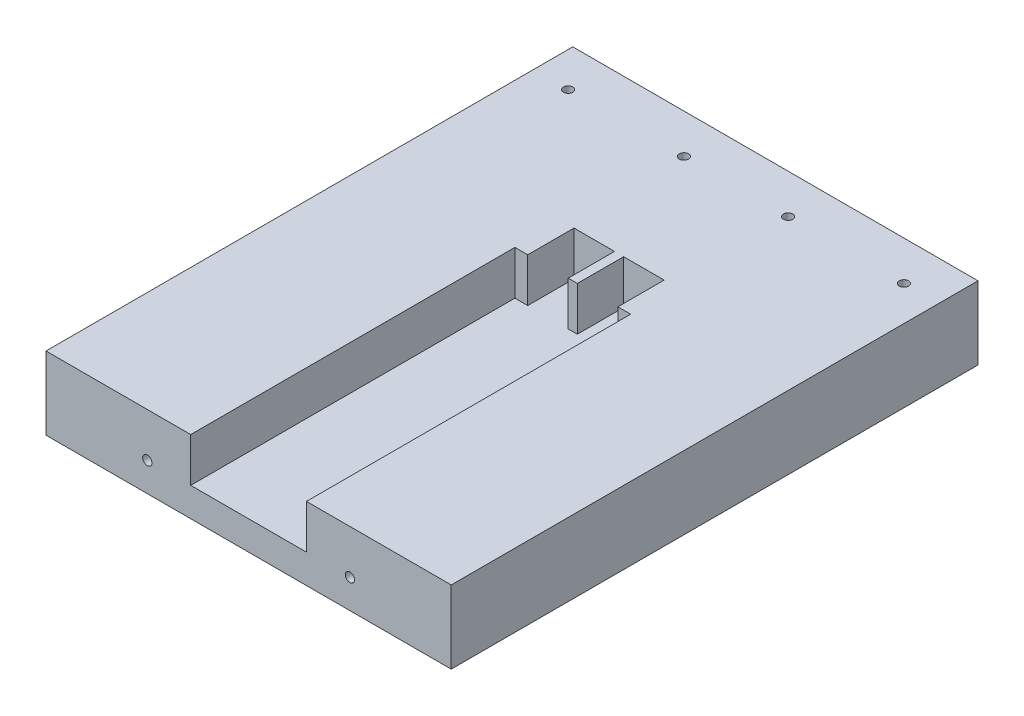
ISO-10303-21;
HEADER;
FILE_DESCRIPTION(('STEP AP214'),'2;1');
FILE_NAME('part.step','',(''),(''),'','','');
FILE_SCHEMA(('AUTOMOTIVE_DESIGN { 1 0 10303 214 1 1 1 1 }'));
ENDSEC;
DATA;
#1=APPLICATION_CONTEXT('core data for automotive mechanical design processes');
#2=APPLICATION_PROTOCOL_DEFINITION('international standard','automotive_design',2000,#1);
#3=PRODUCT_CONTEXT('',#1,'mechanical');
#4=PRODUCT('Part','Part','',(#3));
#5=PRODUCT_RELATED_PRODUCT_CATEGORY('part','',(#4));
#6=PRODUCT_DEFINITION_FORMATION('','',#4);
#7=PRODUCT_DEFINITION_CONTEXT('part definition',#1,'design');
#8=PRODUCT_DEFINITION('design','',#6,#7);
#9=PRODUCT_DEFINITION_SHAPE('','',#8);
#10=(LENGTH_UNIT() NAMED_UNIT(*) SI_UNIT(.MILLI.,.METRE.));
#11=(NAMED_UNIT(*) PLANE_ANGLE_UNIT() SI_UNIT($,.RADIAN.));
#12=(NAMED_UNIT(*) SI_UNIT($,.STERADIAN.) SOLID_ANGLE_UNIT());
#13=UNCERTAINTY_MEASURE_WITH_UNIT(LENGTH_MEASURE(1.E-05),#10,'distance_accuracy_value','');
#14=(GEOMETRIC_REPRESENTATION_CONTEXT(3) GLOBAL_UNCERTAINTY_ASSIGNED_CONTEXT((#13)) GLOBAL_UNIT_ASSIGNED_CONTEXT((#10,
#11,#12)) REPRESENTATION_CONTEXT('',''));
#15=CARTESIAN_POINT('',(0.,0.,0.));
#16=DIRECTION('',(0.,0.,1.));
#17=DIRECTION('',(1.,0.,0.));
#18=AXIS2_PLACEMENT_3D('',#15,#16,#17);
#19=CARTESIAN_POINT('',(0.,16.002,-71.12));
#20=DIRECTION('',(0.,0.,-1.));
#21=DIRECTION('',(-1.,0.,0.));
#22=AXIS2_PLACEMENT_3D('',#19,#20,#21);
#23=PLANE('',#22);
#24=DIRECTION('',(0.,-1.,0.));
#25=VECTOR('',#24,1.);
#26=CARTESIAN_POINT('',(31.75,16.002,-71.12));
#27=LINE('',#26,#25);
#28=CARTESIAN_POINT('',(31.75,16.002,-71.12));
#29=VERTEX_POINT('',#28);
#30=CARTESIAN_POINT('',(31.75,6.35,-71.12));
#31=VERTEX_POINT('',#30);
#32=EDGE_CURVE('E257',#29,#31,#27,.T.);
#33=ORIENTED_EDGE('',*,*,#32,.T.);
#34=DIRECTION('',(1.,0.,0.));
#35=VECTOR('',#34,1.);
#36=CARTESIAN_POINT('',(0.,6.35,-71.12));
#37=LINE('',#36,#35);
#38=CARTESIAN_POINT('',(34.56,6.35,-71.12));
#39=VERTEX_POINT('',#38);
#40=EDGE_CURVE('E166',#31,#39,#37,.T.);
#41=ORIENTED_EDGE('',*,*,#40,.T.);
#42=DIRECTION('',(0.,-1.,0.));
#43=VECTOR('',#42,1.);
#44=CARTESIAN_POINT('',(34.56,16.002,-71.12));
#45=LINE('',#44,#43);
#46=CARTESIAN_POINT('',(34.56,16.002,-71.12));
#47=VERTEX_POINT('',#46);
#48=EDGE_CURVE('E254',#47,#39,#45,.T.);
#49=ORIENTED_EDGE('',*,*,#48,.F.);
#50=DIRECTION('',(1.,0.,0.));
#51=VECTOR('',#50,1.);
#52=CARTESIAN_POINT('',(0.,16.002,-71.12));
#53=LINE('',#52,#51);
#54=EDGE_CURVE('E203',#29,#47,#53,.T.);
#55=ORIENTED_EDGE('',*,*,#54,.F.);
#56=EDGE_LOOP('',(#33,#41,#49,#55));
#57=FACE_BOUND('',#56,.T.);
#58=ADVANCED_FACE('F38',(#57),#23,.F.);
#59=CARTESIAN_POINT('',(54.34,16.002,0.));
#60=DIRECTION('',(-1.,0.,0.));
#61=DIRECTION('',(0.,0.,1.));
#62=AXIS2_PLACEMENT_3D('',#59,#60,#61);
#63=PLANE('',#62);
#64=DIRECTION('',(0.,0.,-1.));
#65=VECTOR('',#64,1.);
#66=CARTESIAN_POINT('',(54.34,6.35,0.));
#67=LINE('',#66,#65);
#68=CARTESIAN_POINT('',(54.34,6.35,-71.12));
#69=VERTEX_POINT('',#68);
#70=CARTESIAN_POINT('',(54.34,6.35,-81.28));
#71=VERTEX_POINT('',#70);
#72=EDGE_CURVE('E158',#69,#71,#67,.T.);
#73=ORIENTED_EDGE('',*,*,#72,.F.);
#74=DIRECTION('',(0.,-1.,0.));
#75=VECTOR('',#74,1.);
#76=CARTESIAN_POINT('',(54.34,16.002,-71.12));
#77=LINE('',#76,#75);
#78=CARTESIAN_POINT('',(54.34,16.002,-71.12));
#79=VERTEX_POINT('',#78);
#80=EDGE_CURVE('E11',#79,#69,#77,.T.);
#81=ORIENTED_EDGE('',*,*,#80,.F.);
#82=DIRECTION('',(0.,0.,-1.));
#83=VECTOR('',#82,1.);
#84=CARTESIAN_POINT('',(54.34,16.002,0.));
#85=LINE('',#84,#83);
#86=CARTESIAN_POINT('',(54.34,16.002,-81.28));
#87=VERTEX_POINT('',#86);
#88=EDGE_CURVE('E197',#79,#87,#85,.T.);
#89=ORIENTED_EDGE('',*,*,#88,.T.);
#90=DIRECTION('',(0.,-1.,0.));
#91=VECTOR('',#90,1.);
#92=CARTESIAN_POINT('',(54.34,16.002,-81.28));
#93=LINE('',#92,#91);
#94=EDGE_CURVE('E173',#87,#71,#93,.T.);
#95=ORIENTED_EDGE('',*,*,#94,.T.);
#96=EDGE_LOOP('',(#73,#81,#89,#95));
#97=FACE_BOUND('',#96,.T.);
#98=ADVANCED_FACE('F40',(#97),#63,.T.);
#99=ORIENTED_EDGE('',*,*,#80,.T.);
#100=CARTESIAN_POINT('',(57.15,6.35,-71.12));
#101=VERTEX_POINT('',#100);
#102=EDGE_CURVE('E154',#69,#101,#37,.T.);
#103=ORIENTED_EDGE('',*,*,#102,.T.);
#104=DIRECTION('',(0.,-1.,0.));
#105=VECTOR('',#104,1.);
#106=CARTESIAN_POINT('',(57.15,16.002,-71.12));
#107=LINE('',#106,#105);
#108=CARTESIAN_POINT('',(57.15,16.002,-71.12));
#109=VERTEX_POINT('',#108);
#110=EDGE_CURVE('E46',#109,#101,#107,.T.);
#111=ORIENTED_EDGE('',*,*,#110,.F.);
#112=EDGE_CURVE('E169',#79,#109,#53,.T.);
#113=ORIENTED_EDGE('',*,*,#112,.F.);
#114=EDGE_LOOP('',(#99,#103,#111,#113));
#115=FACE_BOUND('',#114,.T.);
#116=ADVANCED_FACE('F168',(#115),#23,.F.);
#117=CARTESIAN_POINT('',(57.15,16.002,0.));
#118=DIRECTION('',(-1.,0.,0.));
#119=DIRECTION('',(0.,0.,1.));
#120=AXIS2_PLACEMENT_3D('',#117,#118,#119);
#121=PLANE('',#120);
#122=DIRECTION('',(0.,0.,-1.));
#123=VECTOR('',#122,1.);
#124=CARTESIAN_POINT('',(57.15,6.35,0.));
#125=LINE('',#124,#123);
#126=CARTESIAN_POINT('',(57.15,6.35,0.));
#127=VERTEX_POINT('',#126);
#128=EDGE_CURVE('E160',#127,#101,#125,.T.);
#129=ORIENTED_EDGE('',*,*,#128,.F.);
#130=DIRECTION('',(0.,-1.,0.));
#131=VECTOR('',#130,1.);
#132=CARTESIAN_POINT('',(57.15,16.002,0.));
#133=LINE('',#132,#131);
#134=CARTESIAN_POINT('',(57.15,16.002,0.));
#135=VERTEX_POINT('',#134);
#136=EDGE_CURVE('E272',#135,#127,#133,.T.);
#137=ORIENTED_EDGE('',*,*,#136,.F.);
#138=DIRECTION('',(0.,0.,-1.));
#139=VECTOR('',#138,1.);
#140=CARTESIAN_POINT('',(57.15,16.002,0.));
#141=LINE('',#140,#139);
#142=EDGE_CURVE('E201',#135,#109,#141,.T.);
#143=ORIENTED_EDGE('',*,*,#142,.T.);
#144=ORIENTED_EDGE('',*,*,#110,.T.);
#145=EDGE_LOOP('',(#129,#137,#143,#144));
#146=FACE_BOUND('',#145,.T.);
#147=ADVANCED_FACE('F275',(#146),#121,.T.);
#148=CARTESIAN_POINT('',(88.9,16.002,0.));
#149=DIRECTION('',(-1.,0.,0.));
#150=DIRECTION('',(0.,0.,1.));
#151=AXIS2_PLACEMENT_3D('',#148,#149,#150);
#152=PLANE('',#151);
#153=DIRECTION('',(0.,0.,-1.));
#154=VECTOR('',#153,1.);
#155=CARTESIAN_POINT('',(88.9,0.,0.));
#156=LINE('',#155,#154);
#157=CARTESIAN_POINT('',(88.9,0.,0.));
#158=VERTEX_POINT('',#157);
#159=CARTESIAN_POINT('',(88.9,0.,-115.57));
#160=VERTEX_POINT('',#159);
#161=EDGE_CURVE('E196',#158,#160,#156,.T.);
#162=ORIENTED_EDGE('',*,*,#161,.T.);
#163=DIRECTION('',(0.,-1.,0.));
#164=VECTOR('',#163,1.);
#165=CARTESIAN_POINT('',(88.9,16.002,-115.57));
#166=LINE('',#165,#164);
#167=CARTESIAN_POINT('',(88.9,16.002,-115.57));
#168=VERTEX_POINT('',#167);
#169=EDGE_CURVE('E267',#168,#160,#166,.T.);
#170=ORIENTED_EDGE('',*,*,#169,.F.);
#171=DIRECTION('',(0.,0.,-1.));
#172=VECTOR('',#171,1.);
#173=CARTESIAN_POINT('',(88.9,16.002,0.));
#174=LINE('',#173,#172);
#175=CARTESIAN_POINT('',(88.9,16.002,0.));
#176=VERTEX_POINT('',#175);
#177=EDGE_CURVE('E208',#176,#168,#174,.T.);
#178=ORIENTED_EDGE('',*,*,#177,.F.);
#179=DIRECTION('',(0.,-1.,0.));
#180=VECTOR('',#179,1.);
#181=CARTESIAN_POINT('',(88.9,16.002,0.));
#182=LINE('',#181,#180);
#183=EDGE_CURVE('E269',#176,#158,#182,.T.);
#184=ORIENTED_EDGE('',*,*,#183,.T.);
#185=EDGE_LOOP('',(#162,#170,#178,#184));
#186=FACE_BOUND('',#185,.T.);
#187=ADVANCED_FACE('F342',(#186),#152,.F.);
#188=CARTESIAN_POINT('',(0.,16.002,-115.57));
#189=DIRECTION('',(0.,0.,-1.));
#190=DIRECTION('',(-1.,0.,0.));
#191=AXIS2_PLACEMENT_3D('',#188,#189,#190);
#192=PLANE('',#191);
#193=DIRECTION('',(1.,0.,0.));
#194=VECTOR('',#193,1.);
#195=CARTESIAN_POINT('',(0.,0.,-115.57));
#196=LINE('',#195,#194);
#197=CARTESIAN_POINT('',(0.,0.,-115.57));
#198=VERTEX_POINT('',#197);
#199=EDGE_CURVE('E235',#198,#160,#196,.T.);
#200=ORIENTED_EDGE('',*,*,#199,.F.);
#201=DIRECTION('',(0.,-1.,0.));
#202=VECTOR('',#201,1.);
#203=CARTESIAN_POINT('',(0.,16.002,-115.57));
#204=LINE('',#203,#202);
#205=CARTESIAN_POINT('',(0.,16.002,-115.57));
#206=VERTEX_POINT('',#205);
#207=EDGE_CURVE('E265',#206,#198,#204,.T.);
#208=ORIENTED_EDGE('',*,*,#207,.F.);
#209=DIRECTION('',(1.,0.,0.));
#210=VECTOR('',#209,1.);
#211=CARTESIAN_POINT('',(0.,16.002,-115.57));
#212=LINE('',#211,#210);
#213=EDGE_CURVE('E211',#206,#168,#212,.T.);
#214=ORIENTED_EDGE('',*,*,#213,.T.);
#215=ORIENTED_EDGE('',*,*,#169,.T.);
#216=EDGE_LOOP('',(#200,#208,#214,#215));
#217=FACE_BOUND('',#216,.T.);
#218=ADVANCED_FACE('F349',(#217),#192,.T.);
#219=CARTESIAN_POINT('',(0.,16.002,0.));
#220=DIRECTION('',(-1.,0.,0.));
#221=DIRECTION('',(0.,0.,1.));
#222=AXIS2_PLACEMENT_3D('',#219,#220,#221);
#223=PLANE('',#222);
#224=DIRECTION('',(0.,0.,-1.));
#225=VECTOR('',#224,1.);
#226=CARTESIAN_POINT('',(0.,0.,0.));
#227=LINE('',#226,#225);
#228=CARTESIAN_POINT('',(0.,0.,0.));
#229=VERTEX_POINT('',#228);
#230=EDGE_CURVE('E232',#229,#198,#227,.T.);
#231=ORIENTED_EDGE('',*,*,#230,.F.);
#232=DIRECTION('',(0.,-1.,0.));
#233=VECTOR('',#232,1.);
#234=CARTESIAN_POINT('',(0.,16.002,0.));
#235=LINE('',#234,#233);
#236=CARTESIAN_POINT('',(0.,16.002,0.));
#237=VERTEX_POINT('',#236);
#238=EDGE_CURVE('E263',#237,#229,#235,.T.);
#239=ORIENTED_EDGE('',*,*,#238,.F.);
#240=DIRECTION('',(0.,0.,-1.));
#241=VECTOR('',#240,1.);
#242=CARTESIAN_POINT('',(0.,16.002,0.));
#243=LINE('',#242,#241);
#244=EDGE_CURVE('E214',#237,#206,#243,.T.);
#245=ORIENTED_EDGE('',*,*,#244,.T.);
#246=ORIENTED_EDGE('',*,*,#207,.T.);
#247=EDGE_LOOP('',(#231,#239,#245,#246));
#248=FACE_BOUND('',#247,.T.);
#249=ADVANCED_FACE('F346',(#248),#223,.T.);
#250=CARTESIAN_POINT('',(0.,16.002,0.));
#251=DIRECTION('',(0.,0.,-1.));
#252=DIRECTION('',(-1.,0.,0.));
#253=AXIS2_PLACEMENT_3D('',#250,#251,#252);
#254=PLANE('',#253);
#255=CARTESIAN_POINT('',(66.675,6.35,0.));
#256=DIRECTION('',(0.,0.,1.));
#257=DIRECTION('',(1.,0.,0.));
#258=AXIS2_PLACEMENT_3D('',#255,#256,#257);
#259=CIRCLE('',#258,1.016);
#260=CARTESIAN_POINT('',(67.691,6.35,0.));
#261=VERTEX_POINT('',#260);
#262=EDGE_CURVE('E592',#261,#261,#259,.T.);
#263=ORIENTED_EDGE('',*,*,#262,.F.);
#264=EDGE_LOOP('',(#263));
#265=FACE_BOUND('',#264,.T.);
#266=CARTESIAN_POINT('',(22.225,6.35,0.));
#267=DIRECTION('',(0.,0.,1.));
#268=DIRECTION('',(1.,0.,0.));
#269=AXIS2_PLACEMENT_3D('',#266,#267,#268);
#270=CIRCLE('',#269,1.016);
#271=CARTESIAN_POINT('',(23.241,6.35,0.));
#272=VERTEX_POINT('',#271);
#273=EDGE_CURVE('E595',#272,#272,#270,.T.);
#274=ORIENTED_EDGE('',*,*,#273,.F.);
#275=EDGE_LOOP('',(#274));
#276=FACE_BOUND('',#275,.T.);
#277=DIRECTION('',(1.,0.,0.));
#278=VECTOR('',#277,1.);
#279=CARTESIAN_POINT('',(0.,0.,0.));
#280=LINE('',#279,#278);
#281=EDGE_CURVE('E199',#229,#158,#280,.T.);
#282=ORIENTED_EDGE('',*,*,#281,.T.);
#283=ORIENTED_EDGE('',*,*,#183,.F.);
#284=DIRECTION('',(1.,0.,0.));
#285=VECTOR('',#284,1.);
#286=CARTESIAN_POINT('',(0.,16.002,0.));
#287=LINE('',#286,#285);
#288=EDGE_CURVE('E206',#135,#176,#287,.T.);
#289=ORIENTED_EDGE('',*,*,#288,.F.);
#290=ORIENTED_EDGE('',*,*,#136,.T.);
#291=DIRECTION('',(1.,0.,0.));
#292=VECTOR('',#291,1.);
#293=CARTESIAN_POINT('',(0.,6.35,0.));
#294=LINE('',#293,#292);
#295=CARTESIAN_POINT('',(31.75,6.35,0.));
#296=VERTEX_POINT('',#295);
#297=EDGE_CURVE('E183',#296,#127,#294,.T.);
#298=ORIENTED_EDGE('',*,*,#297,.F.);
#299=DIRECTION('',(0.,-1.,0.));
#300=VECTOR('',#299,1.);
#301=CARTESIAN_POINT('',(31.75,16.002,0.));
#302=LINE('',#301,#300);
#303=CARTESIAN_POINT('',(31.75,16.002,0.));
#304=VERTEX_POINT('',#303);
#305=EDGE_CURVE('E260',#304,#296,#302,.T.);
#306=ORIENTED_EDGE('',*,*,#305,.F.);
#307=EDGE_CURVE('E209',#237,#304,#287,.T.);
#308=ORIENTED_EDGE('',*,*,#307,.F.);
#309=ORIENTED_EDGE('',*,*,#238,.T.);
#310=EDGE_LOOP('',(#282,#283,#289,#290,#298,#306,#308,#309));
#311=FACE_BOUND('',#310,.T.);
#312=ADVANCED_FACE('F336',(#265,#276,#311),#254,.F.);
#313=CARTESIAN_POINT('',(31.75,16.002,0.));
#314=DIRECTION('',(-1.,0.,0.));
#315=DIRECTION('',(0.,0.,1.));
#316=AXIS2_PLACEMENT_3D('',#313,#314,#315);
#317=PLANE('',#316);
#318=ORIENTED_EDGE('',*,*,#305,.T.);
#319=DIRECTION('',(0.,0.,-1.));
#320=VECTOR('',#319,1.);
#321=CARTESIAN_POINT('',(31.75,6.35,0.));
#322=LINE('',#321,#320);
#323=EDGE_CURVE('E186',#296,#31,#322,.T.);
#324=ORIENTED_EDGE('',*,*,#323,.T.);
#325=ORIENTED_EDGE('',*,*,#32,.F.);
#326=DIRECTION('',(0.,0.,-1.));
#327=VECTOR('',#326,1.);
#328=CARTESIAN_POINT('',(31.75,16.002,0.));
#329=LINE('',#328,#327);
#330=EDGE_CURVE('E217',#304,#29,#329,.T.);
#331=ORIENTED_EDGE('',*,*,#330,.F.);
#332=EDGE_LOOP('',(#318,#324,#325,#331));
#333=FACE_BOUND('',#332,.T.);
#334=ADVANCED_FACE('F328',(#333),#317,.F.);
#335=CARTESIAN_POINT('',(34.5599999999999,16.002,0.));
#336=DIRECTION('',(-1.,0.,0.));
#337=DIRECTION('',(0.,0.,1.));
#338=AXIS2_PLACEMENT_3D('',#335,#336,#337);
#339=PLANE('',#338);
#340=ORIENTED_EDGE('',*,*,#48,.T.);
#341=DIRECTION('',(0.,0.,-1.));
#342=VECTOR('',#341,1.);
#343=CARTESIAN_POINT('',(34.5599999999999,6.35,0.));
#344=LINE('',#343,#342);
#345=CARTESIAN_POINT('',(34.56,6.35,-81.28));
#346=VERTEX_POINT('',#345);
#347=EDGE_CURVE('E189',#39,#346,#344,.T.);
#348=ORIENTED_EDGE('',*,*,#347,.T.);
#349=DIRECTION('',(0.,-1.,0.));
#350=VECTOR('',#349,1.);
#351=CARTESIAN_POINT('',(34.56,16.002,-81.28));
#352=LINE('',#351,#350);
#353=CARTESIAN_POINT('',(34.56,16.002,-81.28));
#354=VERTEX_POINT('',#353);
#355=EDGE_CURVE('E251',#354,#346,#352,.T.);
#356=ORIENTED_EDGE('',*,*,#355,.F.);
#357=DIRECTION('',(0.,0.,-1.));
#358=VECTOR('',#357,1.);
#359=CARTESIAN_POINT('',(34.5599999999999,16.002,0.));
#360=LINE('',#359,#358);
#361=EDGE_CURVE('E219',#47,#354,#360,.T.);
#362=ORIENTED_EDGE('',*,*,#361,.F.);
#363=EDGE_LOOP('',(#340,#348,#356,#362));
#364=FACE_BOUND('',#363,.T.);
#365=ADVANCED_FACE('F323',(#364),#339,.F.);
#366=CARTESIAN_POINT('',(0.,16.002,-81.28));
#367=DIRECTION('',(0.,0.,1.));
#368=DIRECTION('',(1.,0.,0.));
#369=AXIS2_PLACEMENT_3D('',#366,#367,#368);
#370=PLANE('',#369);
#371=DIRECTION('',(-1.,0.,0.));
#372=VECTOR('',#371,1.);
#373=CARTESIAN_POINT('',(0.,6.35,-81.28));
#374=LINE('',#373,#372);
#375=CARTESIAN_POINT('',(43.45,6.35,-81.28));
#376=VERTEX_POINT('',#375);
#377=EDGE_CURVE('E194',#376,#346,#374,.T.);
#378=ORIENTED_EDGE('',*,*,#377,.F.);
#379=DIRECTION('',(0.,-1.,0.));
#380=VECTOR('',#379,1.);
#381=CARTESIAN_POINT('',(43.45,16.002,-81.28));
#382=LINE('',#381,#380);
#383=CARTESIAN_POINT('',(43.45,16.002,-81.28));
#384=VERTEX_POINT('',#383);
#385=EDGE_CURVE('E248',#384,#376,#382,.T.);
#386=ORIENTED_EDGE('',*,*,#385,.F.);
#387=DIRECTION('',(-1.,0.,0.));
#388=VECTOR('',#387,1.);
#389=CARTESIAN_POINT('',(0.,16.002,-81.28));
#390=LINE('',#389,#388);
#391=EDGE_CURVE('E221',#384,#354,#390,.T.);
#392=ORIENTED_EDGE('',*,*,#391,.T.);
#393=ORIENTED_EDGE('',*,*,#355,.T.);
#394=EDGE_LOOP('',(#378,#386,#392,#393));
#395=FACE_BOUND('',#394,.T.);
#396=ADVANCED_FACE('F311',(#395),#370,.T.);
#397=CARTESIAN_POINT('',(43.4500000000001,16.002,0.));
#398=DIRECTION('',(-1.,0.,0.));
#399=DIRECTION('',(0.,0.,1.));
#400=AXIS2_PLACEMENT_3D('',#397,#398,#399);
#401=PLANE('',#400);
#402=DIRECTION('',(0.,0.,-1.));
#403=VECTOR('',#402,1.);
#404=CARTESIAN_POINT('',(43.4500000000001,6.35,0.));
#405=LINE('',#404,#403);
#406=CARTESIAN_POINT('',(43.45,6.35,-71.12));
#407=VERTEX_POINT('',#406);
#408=EDGE_CURVE('E192',#407,#376,#405,.T.);
#409=ORIENTED_EDGE('',*,*,#408,.F.);
#410=DIRECTION('',(0.,-1.,0.));
#411=VECTOR('',#410,1.);
#412=CARTESIAN_POINT('',(43.45,16.002,-71.12));
#413=LINE('',#412,#411);
#414=CARTESIAN_POINT('',(43.45,16.002,-71.12));
#415=VERTEX_POINT('',#414);
#416=EDGE_CURVE('E245',#415,#407,#413,.T.);
#417=ORIENTED_EDGE('',*,*,#416,.F.);
#418=DIRECTION('',(0.,0.,-1.));
#419=VECTOR('',#418,1.);
#420=CARTESIAN_POINT('',(43.4500000000001,16.002,0.));
#421=LINE('',#420,#419);
#422=EDGE_CURVE('E224',#415,#384,#421,.T.);
#423=ORIENTED_EDGE('',*,*,#422,.T.);
#424=ORIENTED_EDGE('',*,*,#385,.T.);
#425=EDGE_LOOP('',(#409,#417,#423,#424));
#426=FACE_BOUND('',#425,.T.);
#427=ADVANCED_FACE('F306',(#426),#401,.T.);
#428=ORIENTED_EDGE('',*,*,#416,.T.);
#429=CARTESIAN_POINT('',(45.45,6.35,-71.12));
#430=VERTEX_POINT('',#429);
#431=EDGE_CURVE('E164',#407,#430,#37,.T.);
#432=ORIENTED_EDGE('',*,*,#431,.T.);
#433=DIRECTION('',(0.,-1.,0.));
#434=VECTOR('',#433,1.);
#435=CARTESIAN_POINT('',(45.45,16.002,-71.12));
#436=LINE('',#435,#434);
#437=CARTESIAN_POINT('',(45.45,16.002,-71.12));
#438=VERTEX_POINT('',#437);
#439=EDGE_CURVE('E243',#438,#430,#436,.T.);
#440=ORIENTED_EDGE('',*,*,#439,.F.);
#441=EDGE_CURVE('E202',#415,#438,#53,.T.);
#442=ORIENTED_EDGE('',*,*,#441,.F.);
#443=EDGE_LOOP('',(#428,#432,#440,#442));
#444=FACE_BOUND('',#443,.T.);
#445=ADVANCED_FACE('F294',(#444),#23,.F.);
#446=CARTESIAN_POINT('',(45.4500000000001,16.002,0.));
#447=DIRECTION('',(-1.,0.,0.));
#448=DIRECTION('',(0.,0.,1.));
#449=AXIS2_PLACEMENT_3D('',#446,#447,#448);
#450=PLANE('',#449);
#451=ORIENTED_EDGE('',*,*,#439,.T.);
#452=DIRECTION('',(0.,0.,-1.));
#453=VECTOR('',#452,1.);
#454=CARTESIAN_POINT('',(45.4500000000001,6.35,0.));
#455=LINE('',#454,#453);
#456=CARTESIAN_POINT('',(45.45,6.35,-81.28));
#457=VERTEX_POINT('',#456);
#458=EDGE_CURVE('E53',#430,#457,#455,.T.);
#459=ORIENTED_EDGE('',*,*,#458,.T.);
#460=DIRECTION('',(0.,-1.,0.));
#461=VECTOR('',#460,1.);
#462=CARTESIAN_POINT('',(45.45,16.002,-81.28));
#463=LINE('',#462,#461);
#464=CARTESIAN_POINT('',(45.45,16.002,-81.28));
#465=VERTEX_POINT('',#464);
#466=EDGE_CURVE('E241',#465,#457,#463,.T.);
#467=ORIENTED_EDGE('',*,*,#466,.F.);
#468=DIRECTION('',(0.,0.,-1.));
#469=VECTOR('',#468,1.);
#470=CARTESIAN_POINT('',(45.4500000000001,16.002,0.));
#471=LINE('',#470,#469);
#472=EDGE_CURVE('E227',#438,#465,#471,.T.);
#473=ORIENTED_EDGE('',*,*,#472,.F.);
#474=EDGE_LOOP('',(#451,#459,#467,#473));
#475=FACE_BOUND('',#474,.T.);
#476=ADVANCED_FACE('F285',(#475),#450,.F.);
#477=CARTESIAN_POINT('',(0.,16.002,-81.28));
#478=DIRECTION('',(0.,0.,-1.));
#479=DIRECTION('',(-1.,0.,0.));
#480=AXIS2_PLACEMENT_3D('',#477,#478,#479);
#481=PLANE('',#480);
#482=ORIENTED_EDGE('',*,*,#466,.T.);
#483=DIRECTION('',(1.,0.,0.));
#484=VECTOR('',#483,1.);
#485=CARTESIAN_POINT('',(0.,6.35,-81.28));
#486=LINE('',#485,#484);
#487=EDGE_CURVE('E60',#457,#71,#486,.T.);
#488=ORIENTED_EDGE('',*,*,#487,.T.);
#489=ORIENTED_EDGE('',*,*,#94,.F.);
#490=DIRECTION('',(1.,0.,0.));
#491=VECTOR('',#490,1.);
#492=CARTESIAN_POINT('',(0.,16.002,-81.28));
#493=LINE('',#492,#491);
#494=EDGE_CURVE('E229',#465,#87,#493,.T.);
#495=ORIENTED_EDGE('',*,*,#494,.F.);
#496=EDGE_LOOP('',(#482,#488,#489,#495));
#497=FACE_BOUND('',#496,.T.);
#498=ADVANCED_FACE('F283',(#497),#481,.F.);
#499=CARTESIAN_POINT('',(0.,16.002,0.));
#500=DIRECTION('',(0.,1.,0.));
#501=DIRECTION('',(0.,0.,1.));
#502=AXIS2_PLACEMENT_3D('',#499,#500,#501);
#503=PLANE('',#502);
#504=CARTESIAN_POINT('',(81.28,16.002,-106.934));
#505=DIRECTION('',(0.,1.,0.));
#506=DIRECTION('',(0.,0.,1.));
#507=AXIS2_PLACEMENT_3D('',#504,#505,#506);
#508=CIRCLE('',#507,1.016);
#509=CARTESIAN_POINT('',(81.28,16.002,-105.918));
#510=VERTEX_POINT('',#509);
#511=EDGE_CURVE('E601',#510,#510,#508,.T.);
#512=ORIENTED_EDGE('',*,*,#511,.F.);
#513=EDGE_LOOP('',(#512));
#514=FACE_BOUND('',#513,.T.);
#515=CARTESIAN_POINT('',(55.88,16.002,-106.934));
#516=DIRECTION('',(0.,1.,0.));
#517=DIRECTION('',(0.,0.,1.));
#518=AXIS2_PLACEMENT_3D('',#515,#516,#517);
#519=CIRCLE('',#518,1.016);
#520=CARTESIAN_POINT('',(55.88,16.002,-105.918));
#521=VERTEX_POINT('',#520);
#522=EDGE_CURVE('E610',#521,#521,#519,.T.);
#523=ORIENTED_EDGE('',*,*,#522,.F.);
#524=EDGE_LOOP('',(#523));
#525=FACE_BOUND('',#524,.T.);
#526=CARTESIAN_POINT('',(33.02,16.002,-106.934));
#527=DIRECTION('',(0.,1.,0.));
#528=DIRECTION('',(0.,0.,1.));
#529=AXIS2_PLACEMENT_3D('',#526,#527,#528);
#530=CIRCLE('',#529,1.016);
#531=CARTESIAN_POINT('',(33.02,16.002,-105.918));
#532=VERTEX_POINT('',#531);
#533=EDGE_CURVE('E616',#532,#532,#530,.T.);
#534=ORIENTED_EDGE('',*,*,#533,.F.);
#535=EDGE_LOOP('',(#534));
#536=FACE_BOUND('',#535,.T.);
#537=CARTESIAN_POINT('',(7.62,16.002,-106.934));
#538=DIRECTION('',(0.,1.,0.));
#539=DIRECTION('',(0.,0.,1.));
#540=AXIS2_PLACEMENT_3D('',#537,#538,#539);
#541=CIRCLE('',#540,1.01599999999999);
#542=CARTESIAN_POINT('',(7.62,16.002,-105.918));
#543=VERTEX_POINT('',#542);
#544=EDGE_CURVE('E178',#543,#543,#541,.T.);
#545=ORIENTED_EDGE('',*,*,#544,.F.);
#546=EDGE_LOOP('',(#545));
#547=FACE_BOUND('',#546,.T.);
#548=ORIENTED_EDGE('',*,*,#88,.F.);
#549=ORIENTED_EDGE('',*,*,#112,.T.);
#550=ORIENTED_EDGE('',*,*,#142,.F.);
#551=ORIENTED_EDGE('',*,*,#288,.T.);
#552=ORIENTED_EDGE('',*,*,#177,.T.);
#553=ORIENTED_EDGE('',*,*,#213,.F.);
#554=ORIENTED_EDGE('',*,*,#244,.F.);
#555=ORIENTED_EDGE('',*,*,#307,.T.);
#556=ORIENTED_EDGE('',*,*,#330,.T.);
#557=ORIENTED_EDGE('',*,*,#54,.T.);
#558=ORIENTED_EDGE('',*,*,#361,.T.);
#559=ORIENTED_EDGE('',*,*,#391,.F.);
#560=ORIENTED_EDGE('',*,*,#422,.F.);
#561=ORIENTED_EDGE('',*,*,#441,.T.);
#562=ORIENTED_EDGE('',*,*,#472,.T.);
#563=ORIENTED_EDGE('',*,*,#494,.T.);
#564=EDGE_LOOP('',(#548,#549,#550,#551,#552,#553,#554,#555,#556,#557,#558,#559,#560,#561,#562,#563));
#565=FACE_BOUND('',#564,.T.);
#566=ADVANCED_FACE('F279',(#514,#525,#536,#547,#565),#503,.T.);
#567=CARTESIAN_POINT('',(0.,0.,0.));
#568=DIRECTION('',(0.,1.,0.));
#569=DIRECTION('',(0.,0.,1.));
#570=AXIS2_PLACEMENT_3D('',#567,#568,#569);
#571=PLANE('',#570);
#572=CARTESIAN_POINT('',(81.28,0.,-106.934));
#573=DIRECTION('',(0.,1.,0.));
#574=DIRECTION('',(0.,0.,1.));
#575=AXIS2_PLACEMENT_3D('',#572,#573,#574);
#576=CIRCLE('',#575,1.016);
#577=CARTESIAN_POINT('',(81.28,0.,-105.918));
#578=VERTEX_POINT('',#577);
#579=EDGE_CURVE('E607',#578,#578,#576,.T.);
#580=ORIENTED_EDGE('',*,*,#579,.T.);
#581=EDGE_LOOP('',(#580));
#582=FACE_BOUND('',#581,.T.);
#583=CARTESIAN_POINT('',(55.88,0.,-106.934));
#584=DIRECTION('',(0.,1.,0.));
#585=DIRECTION('',(0.,0.,1.));
#586=AXIS2_PLACEMENT_3D('',#583,#584,#585);
#587=CIRCLE('',#586,1.016);
#588=CARTESIAN_POINT('',(55.88,0.,-105.918));
#589=VERTEX_POINT('',#588);
#590=EDGE_CURVE('E613',#589,#589,#587,.T.);
#591=ORIENTED_EDGE('',*,*,#590,.T.);
#592=EDGE_LOOP('',(#591));
#593=FACE_BOUND('',#592,.T.);
#594=CARTESIAN_POINT('',(33.02,0.,-106.934));
#595=DIRECTION('',(0.,1.,0.));
#596=DIRECTION('',(0.,0.,1.));
#597=AXIS2_PLACEMENT_3D('',#594,#595,#596);
#598=CIRCLE('',#597,1.016);
#599=CARTESIAN_POINT('',(33.02,0.,-105.918));
#600=VERTEX_POINT('',#599);
#601=EDGE_CURVE('E619',#600,#600,#598,.T.);
#602=ORIENTED_EDGE('',*,*,#601,.T.);
#603=EDGE_LOOP('',(#602));
#604=FACE_BOUND('',#603,.T.);
#605=CARTESIAN_POINT('',(7.62,0.,-106.934));
#606=DIRECTION('',(0.,1.,0.));
#607=DIRECTION('',(0.,0.,1.));
#608=AXIS2_PLACEMENT_3D('',#605,#606,#607);
#609=CIRCLE('',#608,1.01599999999999);
#610=CARTESIAN_POINT('',(7.62,0.,-105.918));
#611=VERTEX_POINT('',#610);
#612=EDGE_CURVE('E174',#611,#611,#609,.T.);
#613=ORIENTED_EDGE('',*,*,#612,.T.);
#614=EDGE_LOOP('',(#613));
#615=FACE_BOUND('',#614,.T.);
#616=ORIENTED_EDGE('',*,*,#161,.F.);
#617=ORIENTED_EDGE('',*,*,#281,.F.);
#618=ORIENTED_EDGE('',*,*,#230,.T.);
#619=ORIENTED_EDGE('',*,*,#199,.T.);
#620=EDGE_LOOP('',(#616,#617,#618,#619));
#621=FACE_BOUND('',#620,.T.);
#622=ADVANCED_FACE('F291',(#582,#593,#604,#615,#621),#571,.F.);
#623=CARTESIAN_POINT('',(0.,6.35,0.));
#624=DIRECTION('',(0.,1.,0.));
#625=DIRECTION('',(0.,0.,1.));
#626=AXIS2_PLACEMENT_3D('',#623,#624,#625);
#627=PLANE('',#626);
#628=ORIENTED_EDGE('',*,*,#347,.F.);
#629=ORIENTED_EDGE('',*,*,#40,.F.);
#630=ORIENTED_EDGE('',*,*,#323,.F.);
#631=ORIENTED_EDGE('',*,*,#297,.T.);
#632=ORIENTED_EDGE('',*,*,#128,.T.);
#633=ORIENTED_EDGE('',*,*,#102,.F.);
#634=ORIENTED_EDGE('',*,*,#72,.T.);
#635=ORIENTED_EDGE('',*,*,#487,.F.);
#636=ORIENTED_EDGE('',*,*,#458,.F.);
#637=ORIENTED_EDGE('',*,*,#431,.F.);
#638=ORIENTED_EDGE('',*,*,#408,.T.);
#639=ORIENTED_EDGE('',*,*,#377,.T.);
#640=EDGE_LOOP('',(#628,#629,#630,#631,#632,#633,#634,#635,#636,#637,#638,#639));
#641=FACE_BOUND('',#640,.T.);
#642=ADVANCED_FACE('F156',(#641),#627,.T.);
#643=CARTESIAN_POINT('',(7.62,0.,-106.934));
#644=DIRECTION('',(0.,1.,0.));
#645=DIRECTION('',(0.,0.,1.));
#646=AXIS2_PLACEMENT_3D('',#643,#644,#645);
#647=CYLINDRICAL_SURFACE('',#646,1.01599999999999);
#648=ORIENTED_EDGE('',*,*,#612,.F.);
#649=EDGE_LOOP('',(#648));
#650=FACE_BOUND('',#649,.T.);
#651=ORIENTED_EDGE('',*,*,#544,.T.);
#652=EDGE_LOOP('',(#651));
#653=FACE_BOUND('',#652,.T.);
#654=ADVANCED_FACE('F443',(#650,#653),#647,.F.);
#655=CARTESIAN_POINT('',(33.02,0.,-106.934));
#656=DIRECTION('',(0.,1.,0.));
#657=DIRECTION('',(0.,0.,1.));
#658=AXIS2_PLACEMENT_3D('',#655,#656,#657);
#659=CYLINDRICAL_SURFACE('',#658,1.016);
#660=ORIENTED_EDGE('',*,*,#601,.F.);
#661=EDGE_LOOP('',(#660));
#662=FACE_BOUND('',#661,.T.);
#663=ORIENTED_EDGE('',*,*,#533,.T.);
#664=EDGE_LOOP('',(#663));
#665=FACE_BOUND('',#664,.T.);
#666=ADVANCED_FACE('F456',(#662,#665),#659,.F.);
#667=CARTESIAN_POINT('',(55.88,0.,-106.934));
#668=DIRECTION('',(0.,1.,0.));
#669=DIRECTION('',(0.,0.,1.));
#670=AXIS2_PLACEMENT_3D('',#667,#668,#669);
#671=CYLINDRICAL_SURFACE('',#670,1.016);
#672=ORIENTED_EDGE('',*,*,#590,.F.);
#673=EDGE_LOOP('',(#672));
#674=FACE_BOUND('',#673,.T.);
#675=ORIENTED_EDGE('',*,*,#522,.T.);
#676=EDGE_LOOP('',(#675));
#677=FACE_BOUND('',#676,.T.);
#678=ADVANCED_FACE('F465',(#674,#677),#671,.F.);
#679=CARTESIAN_POINT('',(81.28,0.,-106.934));
#680=DIRECTION('',(0.,1.,0.));
#681=DIRECTION('',(0.,0.,1.));
#682=AXIS2_PLACEMENT_3D('',#679,#680,#681);
#683=CYLINDRICAL_SURFACE('',#682,1.016);
#684=ORIENTED_EDGE('',*,*,#579,.F.);
#685=EDGE_LOOP('',(#684));
#686=FACE_BOUND('',#685,.T.);
#687=ORIENTED_EDGE('',*,*,#511,.T.);
#688=EDGE_LOOP('',(#687));
#689=FACE_BOUND('',#688,.T.);
#690=ADVANCED_FACE('F474',(#686,#689),#683,.F.);
#691=CARTESIAN_POINT('',(22.225,6.35,-12.7));
#692=DIRECTION('',(0.,0.,1.));
#693=DIRECTION('',(1.,0.,0.));
#694=AXIS2_PLACEMENT_3D('',#691,#692,#693);
#695=CYLINDRICAL_SURFACE('',#694,1.016);
#696=CARTESIAN_POINT('',(22.225,6.35,-12.7));
#697=DIRECTION('',(0.,0.,1.));
#698=DIRECTION('',(1.,0.,0.));
#699=AXIS2_PLACEMENT_3D('',#696,#697,#698);
#700=CIRCLE('',#699,1.016);
#701=CARTESIAN_POINT('',(23.241,6.35,-12.7));
#702=VERTEX_POINT('',#701);
#703=EDGE_CURVE('E597',#702,#702,#700,.T.);
#704=ORIENTED_EDGE('',*,*,#703,.F.);
#705=EDGE_LOOP('',(#704));
#706=FACE_BOUND('',#705,.T.);
#707=ORIENTED_EDGE('',*,*,#273,.T.);
#708=EDGE_LOOP('',(#707));
#709=FACE_BOUND('',#708,.T.);
#710=ADVANCED_FACE('F483',(#706,#709),#695,.F.);
#711=CARTESIAN_POINT('',(22.225,6.35,-12.7));
#712=DIRECTION('',(0.,0.,1.));
#713=DIRECTION('',(1.,0.,0.));
#714=AXIS2_PLACEMENT_3D('',#711,#712,#713);
#715=PLANE('',#714);
#716=ORIENTED_EDGE('',*,*,#703,.T.);
#717=EDGE_LOOP('',(#716));
#718=FACE_BOUND('',#717,.T.);
#719=ADVANCED_FACE('F493',(#718),#715,.T.);
#720=CARTESIAN_POINT('',(66.675,6.35,-12.7));
#721=DIRECTION('',(0.,0.,1.));
#722=DIRECTION('',(1.,0.,0.));
#723=AXIS2_PLACEMENT_3D('',#720,#721,#722);
#724=CYLINDRICAL_SURFACE('',#723,1.016);
#725=CARTESIAN_POINT('',(66.675,6.35,-12.7));
#726=DIRECTION('',(0.,0.,1.));
#727=DIRECTION('',(1.,0.,0.));
#728=AXIS2_PLACEMENT_3D('',#725,#726,#727);
#729=CIRCLE('',#728,1.016);
#730=CARTESIAN_POINT('',(67.691,6.35,-12.7));
#731=VERTEX_POINT('',#730);
#732=EDGE_CURVE('E598',#731,#731,#729,.T.);
#733=ORIENTED_EDGE('',*,*,#732,.F.);
#734=EDGE_LOOP('',(#733));
#735=FACE_BOUND('',#734,.T.);
#736=ORIENTED_EDGE('',*,*,#262,.T.);
#737=EDGE_LOOP('',(#736));
#738=FACE_BOUND('',#737,.T.);
#739=ADVANCED_FACE('F502',(#735,#738),#724,.F.);
#740=CARTESIAN_POINT('',(66.675,6.35,-12.7));
#741=DIRECTION('',(0.,0.,1.));
#742=DIRECTION('',(1.,0.,0.));
#743=AXIS2_PLACEMENT_3D('',#740,#741,#742);
#744=PLANE('',#743);
#745=ORIENTED_EDGE('',*,*,#732,.T.);
#746=EDGE_LOOP('',(#745));
#747=FACE_BOUND('',#746,.T.);
#748=ADVANCED_FACE('F511',(#747),#744,.T.);
#749=CLOSED_SHELL('',(#58,#98,#116,#147,#187,#218,#249,#312,#334,#365,#396,#427,#445,#476,#498,
#566,#622,#642,#654,#666,#678,#690,#710,#719,#739,#748));
#750=MANIFOLD_SOLID_BREP('B2',#749);
#751=ADVANCED_BREP_SHAPE_REPRESENTATION('',(#18,#750),#14);
#752=SHAPE_DEFINITION_REPRESENTATION(#9,#751);
ENDSEC;
END-ISO-10303-21;
